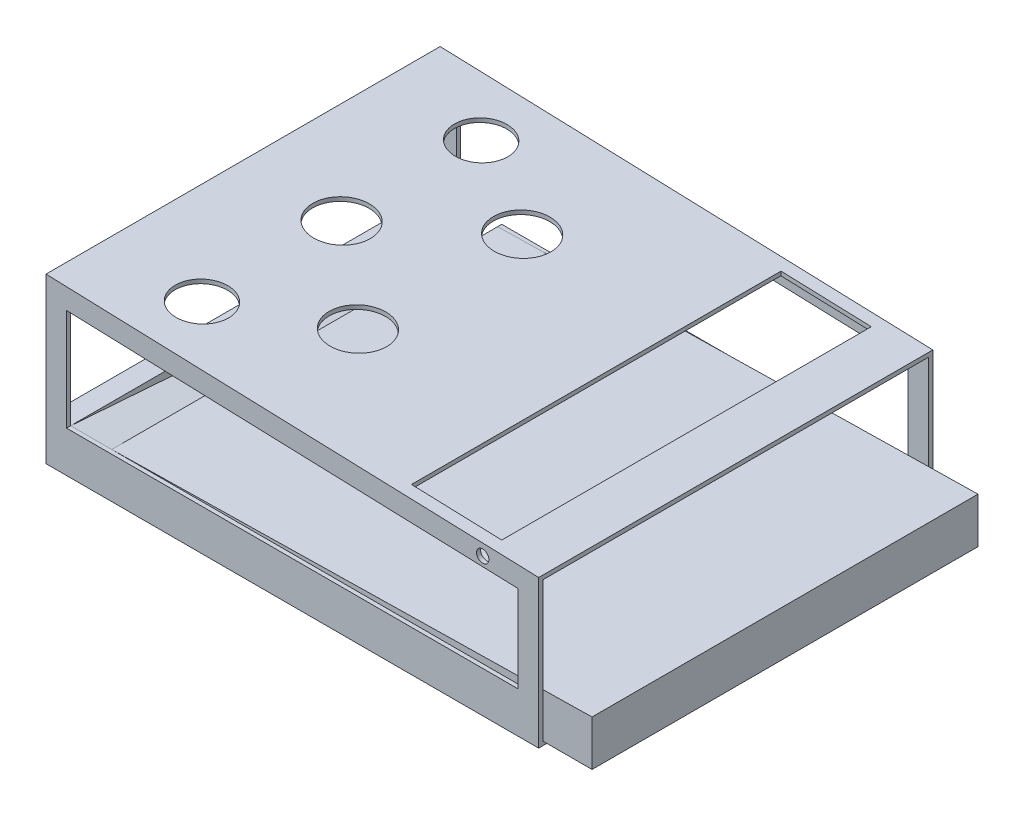
ISO-10303-21;
HEADER;
FILE_DESCRIPTION(('STEP AP214'),'2;1');
FILE_NAME('part.step','',(''),(''),'','','');
FILE_SCHEMA(('AUTOMOTIVE_DESIGN { 1 0 10303 214 1 1 1 1 }'));
ENDSEC;
DATA;
#1=APPLICATION_CONTEXT('core data for automotive mechanical design processes');
#2=APPLICATION_PROTOCOL_DEFINITION('international standard','automotive_design',2000,#1);
#3=PRODUCT_CONTEXT('',#1,'mechanical');
#4=PRODUCT('Part','Part','',(#3));
#5=PRODUCT_RELATED_PRODUCT_CATEGORY('part','',(#4));
#6=PRODUCT_DEFINITION_FORMATION('','',#4);
#7=PRODUCT_DEFINITION_CONTEXT('part definition',#1,'design');
#8=PRODUCT_DEFINITION('design','',#6,#7);
#9=PRODUCT_DEFINITION_SHAPE('','',#8);
#10=(LENGTH_UNIT() NAMED_UNIT(*) SI_UNIT(.MILLI.,.METRE.));
#11=(NAMED_UNIT(*) PLANE_ANGLE_UNIT() SI_UNIT($,.RADIAN.));
#12=(NAMED_UNIT(*) SI_UNIT($,.STERADIAN.) SOLID_ANGLE_UNIT());
#13=UNCERTAINTY_MEASURE_WITH_UNIT(LENGTH_MEASURE(1.E-05),#10,'distance_accuracy_value','');
#14=(GEOMETRIC_REPRESENTATION_CONTEXT(3) GLOBAL_UNCERTAINTY_ASSIGNED_CONTEXT((#13)) GLOBAL_UNIT_ASSIGNED_CONTEXT((#10,
#11,#12)) REPRESENTATION_CONTEXT('',''));
#15=CARTESIAN_POINT('',(0.,0.,0.));
#16=DIRECTION('',(0.,0.,1.));
#17=DIRECTION('',(1.,0.,0.));
#18=AXIS2_PLACEMENT_3D('',#15,#16,#17);
#19=CARTESIAN_POINT('',(0.,0.,-603.25));
#20=DIRECTION('',(0.,0.,-1.));
#21=DIRECTION('',(-1.,0.,0.));
#22=AXIS2_PLACEMENT_3D('',#19,#20,#21);
#23=PLANE('',#22);
#24=CARTESIAN_POINT('',(301.467767378111,213.990365251798,-603.25));
#25=DIRECTION('',(0.,0.,-1.));
#26=DIRECTION('',(-1.,0.,0.));
#27=AXIS2_PLACEMENT_3D('',#24,#25,#26);
#28=CIRCLE('',#27,9.52500000000002);
#29=CARTESIAN_POINT('',(291.942767378111,213.990365251798,-603.25));
#30=VERTEX_POINT('',#29);
#31=EDGE_CURVE('E591',#30,#30,#28,.T.);
#32=ORIENTED_EDGE('',*,*,#31,.T.);
#33=EDGE_LOOP('',(#32));
#34=FACE_BOUND('',#33,.T.);
#35=DIRECTION('',(0.,-1.,0.));
#36=VECTOR('',#35,1.);
#37=CARTESIAN_POINT('',(-373.981578947369,0.,-603.25));
#38=LINE('',#37,#36);
#39=CARTESIAN_POINT('',(-373.981578947369,247.646473201616,-603.25));
#40=VERTEX_POINT('',#39);
#41=CARTESIAN_POINT('',(-373.981578947369,63.4999999999999,-603.25));
#42=VERTEX_POINT('',#41);
#43=EDGE_CURVE('E454',#40,#42,#38,.T.);
#44=ORIENTED_EDGE('',*,*,#43,.T.);
#45=DIRECTION('',(1.,0.,0.));
#46=VECTOR('',#45,1.);
#47=CARTESIAN_POINT('',(0.,63.4999999999999,-603.25));
#48=LINE('',#47,#46);
#49=CARTESIAN_POINT('',(-342.231578947369,63.4999999999999,-603.25));
#50=VERTEX_POINT('',#49);
#51=EDGE_CURVE('E326',#42,#50,#48,.T.);
#52=ORIENTED_EDGE('',*,*,#51,.T.);
#53=DIRECTION('',(0.,1.,0.));
#54=VECTOR('',#53,1.);
#55=CARTESIAN_POINT('',(-342.231578947369,0.,-603.25));
#56=LINE('',#55,#54);
#57=CARTESIAN_POINT('',(-342.231578947369,221.174032674749,-603.25));
#58=VERTEX_POINT('',#57);
#59=EDGE_CURVE('E441',#50,#58,#56,.T.);
#60=ORIENTED_EDGE('',*,*,#59,.T.);
#61=DIRECTION('',(0.999444906979154,-0.0333148302326383,0.));
#62=VECTOR('',#61,1.);
#63=CARTESIAN_POINT('',(6.98444994594347,209.533498378305,-603.25));
#64=LINE('',#63,#62);
#65=CARTESIAN_POINT('',(356.268421052631,197.890699341416,-603.25));
#66=VERTEX_POINT('',#65);
#67=EDGE_CURVE('E445',#58,#66,#64,.T.);
#68=ORIENTED_EDGE('',*,*,#67,.T.);
#69=DIRECTION('',(0.,-1.,0.));
#70=VECTOR('',#69,1.);
#71=CARTESIAN_POINT('',(356.268421052632,1.47159515479055E-13,-603.25));
#72=LINE('',#71,#70);
#73=CARTESIAN_POINT('',(356.268421052631,74.7790793881739,-603.25));
#74=VERTEX_POINT('',#73);
#75=EDGE_CURVE('E433',#66,#74,#72,.T.);
#76=ORIENTED_EDGE('',*,*,#75,.T.);
#77=DIRECTION('',(-0.999842287138879,-0.0177595283973115,0.));
#78=VECTOR('',#77,1.);
#79=CARTESIAN_POINT('',(-278.731578947369,63.4999999999999,-603.25));
#80=LINE('',#79,#78);
#81=CARTESIAN_POINT('',(388.018421052632,75.3430333575826,-603.25));
#82=VERTEX_POINT('',#81);
#83=EDGE_CURVE('E366',#82,#74,#80,.T.);
#84=ORIENTED_EDGE('',*,*,#83,.F.);
#85=DIRECTION('',(0.,1.,0.));
#86=VECTOR('',#85,1.);
#87=CARTESIAN_POINT('',(388.018421052632,0.,-603.25));
#88=LINE('',#87,#86);
#89=CARTESIAN_POINT('',(388.018421052632,222.246473201617,-603.25));
#90=VERTEX_POINT('',#89);
#91=EDGE_CURVE('E465',#82,#90,#88,.T.);
#92=ORIENTED_EDGE('',*,*,#91,.T.);
#93=DIRECTION('',(-0.999444906979154,0.0333148302326384,0.));
#94=VECTOR('',#93,1.);
#95=CARTESIAN_POINT('',(-374.193128119346,247.653524840682,-603.25));
#96=LINE('',#95,#94);
#97=EDGE_CURVE('E450',#90,#40,#96,.T.);
#98=ORIENTED_EDGE('',*,*,#97,.T.);
#99=EDGE_LOOP('',(#44,#52,#60,#68,#76,#84,#92,#98));
#100=FACE_BOUND('',#99,.T.);
#101=ADVANCED_FACE('F44',(#34,#100),#23,.F.);
#102=CARTESIAN_POINT('',(0.,0.,-6.35));
#103=DIRECTION('',(0.,0.,-1.));
#104=DIRECTION('',(-1.,0.,0.));
#105=AXIS2_PLACEMENT_3D('',#102,#103,#104);
#106=PLANE('',#105);
#107=CARTESIAN_POINT('',(301.467767378111,213.990365251798,-6.34999999999997));
#108=DIRECTION('',(0.,0.,-1.));
#109=DIRECTION('',(-1.,0.,0.));
#110=AXIS2_PLACEMENT_3D('',#107,#108,#109);
#111=CIRCLE('',#110,9.52500000000002);
#112=CARTESIAN_POINT('',(291.942767378111,213.990365251798,-6.34999999999997));
#113=VERTEX_POINT('',#112);
#114=EDGE_CURVE('E596',#113,#113,#111,.T.);
#115=ORIENTED_EDGE('',*,*,#114,.F.);
#116=EDGE_LOOP('',(#115));
#117=FACE_BOUND('',#116,.T.);
#118=DIRECTION('',(0.,1.,0.));
#119=VECTOR('',#118,1.);
#120=CARTESIAN_POINT('',(-342.231578947369,0.,-6.35));
#121=LINE('',#120,#119);
#122=CARTESIAN_POINT('',(-342.231578947369,63.4999999999999,-6.35));
#123=VERTEX_POINT('',#122);
#124=CARTESIAN_POINT('',(-342.231578947369,221.174032674749,-6.35000000000008));
#125=VERTEX_POINT('',#124);
#126=EDGE_CURVE('E537',#123,#125,#121,.T.);
#127=ORIENTED_EDGE('',*,*,#126,.F.);
#128=DIRECTION('',(1.,0.,0.));
#129=VECTOR('',#128,1.);
#130=CARTESIAN_POINT('',(-973.611241739329,63.4999999999999,-6.35));
#131=LINE('',#130,#129);
#132=CARTESIAN_POINT('',(-373.981578947369,63.4999999999999,-6.34999999999997));
#133=VERTEX_POINT('',#132);
#134=EDGE_CURVE('E332',#133,#123,#131,.T.);
#135=ORIENTED_EDGE('',*,*,#134,.F.);
#136=DIRECTION('',(0.,-1.,0.));
#137=VECTOR('',#136,1.);
#138=CARTESIAN_POINT('',(-373.981578947369,0.,-6.34999999999997));
#139=LINE('',#138,#137);
#140=CARTESIAN_POINT('',(-373.981578947369,247.646473201616,-6.35));
#141=VERTEX_POINT('',#140);
#142=EDGE_CURVE('E460',#141,#133,#139,.T.);
#143=ORIENTED_EDGE('',*,*,#142,.F.);
#144=DIRECTION('',(-0.999444906979154,0.0333148302326384,0.));
#145=VECTOR('',#144,1.);
#146=CARTESIAN_POINT('',(-374.193128119346,247.653524840682,-6.34999999999997));
#147=LINE('',#146,#145);
#148=CARTESIAN_POINT('',(388.018421052632,222.246473201617,-6.35));
#149=VERTEX_POINT('',#148);
#150=EDGE_CURVE('E456',#149,#141,#147,.T.);
#151=ORIENTED_EDGE('',*,*,#150,.F.);
#152=DIRECTION('',(0.,1.,0.));
#153=VECTOR('',#152,1.);
#154=CARTESIAN_POINT('',(388.018421052632,0.,-6.34999999999997));
#155=LINE('',#154,#153);
#156=CARTESIAN_POINT('',(388.018421052632,75.3430333575826,-6.34999999999998));
#157=VERTEX_POINT('',#156);
#158=EDGE_CURVE('E449',#157,#149,#155,.T.);
#159=ORIENTED_EDGE('',*,*,#158,.F.);
#160=DIRECTION('',(0.999842287138879,0.0177595283973115,0.));
#161=VECTOR('',#160,1.);
#162=CARTESIAN_POINT('',(-278.731578947369,63.4999999999999,-6.34999999999997));
#163=LINE('',#162,#161);
#164=CARTESIAN_POINT('',(356.268421052631,74.7790793881739,-6.35));
#165=VERTEX_POINT('',#164);
#166=EDGE_CURVE('E381',#165,#157,#163,.T.);
#167=ORIENTED_EDGE('',*,*,#166,.F.);
#168=DIRECTION('',(0.,-1.,0.));
#169=VECTOR('',#168,1.);
#170=CARTESIAN_POINT('',(356.268421052632,1.47159515479055E-13,-6.35));
#171=LINE('',#170,#169);
#172=CARTESIAN_POINT('',(356.268421052631,197.890699341416,-6.35));
#173=VERTEX_POINT('',#172);
#174=EDGE_CURVE('E520',#173,#165,#171,.T.);
#175=ORIENTED_EDGE('',*,*,#174,.F.);
#176=DIRECTION('',(0.999444906979154,-0.0333148302326383,0.));
#177=VECTOR('',#176,1.);
#178=CARTESIAN_POINT('',(6.98444994594347,209.533498378305,-6.35));
#179=LINE('',#178,#177);
#180=EDGE_CURVE('E53',#125,#173,#179,.T.);
#181=ORIENTED_EDGE('',*,*,#180,.F.);
#182=EDGE_LOOP('',(#127,#135,#143,#151,#159,#167,#175,#181));
#183=FACE_BOUND('',#182,.T.);
#184=ADVANCED_FACE('F547',(#117,#183),#106,.T.);
#185=CARTESIAN_POINT('',(-278.731578947369,63.4999999999999,739.92296331965));
#186=DIRECTION('',(1.,0.,0.));
#187=DIRECTION('',(0.,0.,-1.));
#188=AXIS2_PLACEMENT_3D('',#185,#186,#187);
#189=PLANE('',#188);
#190=DIRECTION('',(0.,-0.0742624587146073,-0.997238731310443));
#191=VECTOR('',#190,1.);
#192=CARTESIAN_POINT('',(-278.731578947369,63.4999999999999,-6.35));
#193=LINE('',#192,#191);
#194=CARTESIAN_POINT('',(-278.731578947369,63.4999999999999,-6.35));
#195=VERTEX_POINT('',#194);
#196=CARTESIAN_POINT('',(-278.731578947369,19.05,-603.25));
#197=VERTEX_POINT('',#196);
#198=EDGE_CURVE('E333',#195,#197,#193,.T.);
#199=ORIENTED_EDGE('',*,*,#198,.F.);
#200=DIRECTION('',(0.,0.,-1.));
#201=VECTOR('',#200,1.);
#202=CARTESIAN_POINT('',(-278.731578947369,63.4999999999999,739.92296331965));
#203=LINE('',#202,#201);
#204=CARTESIAN_POINT('',(-278.731578947369,63.4999999999999,-603.25));
#205=VERTEX_POINT('',#204);
#206=EDGE_CURVE('E365',#195,#205,#203,.T.);
#207=ORIENTED_EDGE('',*,*,#206,.T.);
#208=DIRECTION('',(0.,0.,-1.));
#209=VECTOR('',#208,1.);
#210=CARTESIAN_POINT('',(-278.731578947369,63.4999999999999,-525.738371840091));
#211=LINE('',#210,#209);
#212=CARTESIAN_POINT('',(-278.731578947369,63.4999999999999,-609.6));
#213=VERTEX_POINT('',#212);
#214=EDGE_CURVE('E312',#205,#213,#211,.T.);
#215=ORIENTED_EDGE('',*,*,#214,.T.);
#216=DIRECTION('',(0.,-1.,0.));
#217=VECTOR('',#216,1.);
#218=CARTESIAN_POINT('',(-278.731578947369,63.4999999999999,-609.6));
#219=LINE('',#218,#217);
#220=CARTESIAN_POINT('',(-278.731578947369,19.05,-609.6));
#221=VERTEX_POINT('',#220);
#222=EDGE_CURVE('E303',#213,#221,#219,.T.);
#223=ORIENTED_EDGE('',*,*,#222,.T.);
#224=DIRECTION('',(0.,0.,-1.));
#225=VECTOR('',#224,1.);
#226=CARTESIAN_POINT('',(-278.731578947369,19.05,-525.738371840091));
#227=LINE('',#226,#225);
#228=EDGE_CURVE('E311',#197,#221,#227,.T.);
#229=ORIENTED_EDGE('',*,*,#228,.F.);
#230=EDGE_LOOP('',(#199,#207,#215,#223,#229));
#231=FACE_BOUND('',#230,.T.);
#232=ADVANCED_FACE('F655',(#231),#189,.F.);
#233=CARTESIAN_POINT('',(388.018421052632,0.,-609.6));
#234=DIRECTION('',(1.,0.,0.));
#235=DIRECTION('',(0.,0.,-1.));
#236=AXIS2_PLACEMENT_3D('',#233,#234,#235);
#237=PLANE('',#236);
#238=DIRECTION('',(0.,1.,0.));
#239=VECTOR('',#238,1.);
#240=CARTESIAN_POINT('',(388.018421052632,0.,0.));
#241=LINE('',#240,#239);
#242=CARTESIAN_POINT('',(388.018421052632,0.,0.));
#243=VERTEX_POINT('',#242);
#244=CARTESIAN_POINT('',(388.018421052632,228.6,0.));
#245=VERTEX_POINT('',#244);
#246=EDGE_CURVE('E476',#243,#245,#241,.T.);
#247=ORIENTED_EDGE('',*,*,#246,.F.);
#248=DIRECTION('',(0.,0.,1.));
#249=VECTOR('',#248,1.);
#250=CARTESIAN_POINT('',(388.018421052632,0.,-609.6));
#251=LINE('',#250,#249);
#252=CARTESIAN_POINT('',(388.018421052632,0.,-609.6));
#253=VERTEX_POINT('',#252);
#254=EDGE_CURVE('E517',#253,#243,#251,.T.);
#255=ORIENTED_EDGE('',*,*,#254,.F.);
#256=DIRECTION('',(0.,1.,0.));
#257=VECTOR('',#256,1.);
#258=CARTESIAN_POINT('',(388.018421052632,0.,-609.6));
#259=LINE('',#258,#257);
#260=CARTESIAN_POINT('',(388.018421052632,228.6,-609.6));
#261=VERTEX_POINT('',#260);
#262=EDGE_CURVE('E486',#253,#261,#259,.T.);
#263=ORIENTED_EDGE('',*,*,#262,.T.);
#264=DIRECTION('',(0.,0.,1.));
#265=VECTOR('',#264,1.);
#266=CARTESIAN_POINT('',(388.018421052632,228.6,-609.6));
#267=LINE('',#266,#265);
#268=EDGE_CURVE('E502',#261,#245,#267,.T.);
#269=ORIENTED_EDGE('',*,*,#268,.T.);
#270=EDGE_LOOP('',(#247,#255,#263,#269));
#271=FACE_BOUND('',#270,.T.);
#272=DIRECTION('',(0.,0.,1.));
#273=VECTOR('',#272,1.);
#274=CARTESIAN_POINT('',(388.018421052632,6.35,-609.6));
#275=LINE('',#274,#273);
#276=CARTESIAN_POINT('',(388.018421052632,6.35,-603.25));
#277=VERTEX_POINT('',#276);
#278=CARTESIAN_POINT('',(388.018421052632,6.35,-6.35));
#279=VERTEX_POINT('',#278);
#280=EDGE_CURVE('E470',#277,#279,#275,.T.);
#281=ORIENTED_EDGE('',*,*,#280,.T.);
#282=EDGE_CURVE('E461',#279,#157,#155,.T.);
#283=ORIENTED_EDGE('',*,*,#282,.T.);
#284=ORIENTED_EDGE('',*,*,#158,.T.);
#285=DIRECTION('',(0.,0.,1.));
#286=VECTOR('',#285,1.);
#287=CARTESIAN_POINT('',(388.018421052632,222.246473201617,-609.6));
#288=LINE('',#287,#286);
#289=EDGE_CURVE('E471',#90,#149,#288,.T.);
#290=ORIENTED_EDGE('',*,*,#289,.F.);
#291=ORIENTED_EDGE('',*,*,#91,.F.);
#292=EDGE_CURVE('E455',#277,#82,#88,.T.);
#293=ORIENTED_EDGE('',*,*,#292,.F.);
#294=EDGE_LOOP('',(#281,#283,#284,#290,#291,#293));
#295=FACE_BOUND('',#294,.T.);
#296=ADVANCED_FACE('F46',(#271,#295),#237,.T.);
#297=CARTESIAN_POINT('',(-373.981578947369,0.,-609.6));
#298=DIRECTION('',(-1.,0.,0.));
#299=DIRECTION('',(0.,0.,1.));
#300=AXIS2_PLACEMENT_3D('',#297,#298,#299);
#301=PLANE('',#300);
#302=DIRECTION('',(0.,0.,-1.));
#303=VECTOR('',#302,1.);
#304=CARTESIAN_POINT('',(-373.981578947369,63.4999999999999,48.2747654457206));
#305=LINE('',#304,#303);
#306=EDGE_CURVE('E315',#133,#42,#305,.T.);
#307=ORIENTED_EDGE('',*,*,#306,.T.);
#308=ORIENTED_EDGE('',*,*,#43,.F.);
#309=DIRECTION('',(0.,0.,1.));
#310=VECTOR('',#309,1.);
#311=CARTESIAN_POINT('',(-373.981578947369,247.646473201616,-609.6));
#312=LINE('',#311,#310);
#313=EDGE_CURVE('E466',#40,#141,#312,.T.);
#314=ORIENTED_EDGE('',*,*,#313,.T.);
#315=ORIENTED_EDGE('',*,*,#142,.T.);
#316=EDGE_LOOP('',(#307,#308,#314,#315));
#317=FACE_BOUND('',#316,.T.);
#318=DIRECTION('',(0.,-1.,0.));
#319=VECTOR('',#318,1.);
#320=CARTESIAN_POINT('',(-373.981578947369,0.,-609.6));
#321=LINE('',#320,#319);
#322=CARTESIAN_POINT('',(-373.981578947369,254.,-609.6));
#323=VERTEX_POINT('',#322);
#324=CARTESIAN_POINT('',(-373.981578947369,0.,-609.6));
#325=VERTEX_POINT('',#324);
#326=EDGE_CURVE('E495',#323,#325,#321,.T.);
#327=ORIENTED_EDGE('',*,*,#326,.T.);
#328=DIRECTION('',(0.,0.,1.));
#329=VECTOR('',#328,1.);
#330=CARTESIAN_POINT('',(-373.981578947369,0.,-609.6));
#331=LINE('',#330,#329);
#332=CARTESIAN_POINT('',(-373.981578947369,0.,0.));
#333=VERTEX_POINT('',#332);
#334=EDGE_CURVE('E521',#325,#333,#331,.T.);
#335=ORIENTED_EDGE('',*,*,#334,.T.);
#336=DIRECTION('',(0.,-1.,0.));
#337=VECTOR('',#336,1.);
#338=CARTESIAN_POINT('',(-373.981578947369,0.,0.));
#339=LINE('',#338,#337);
#340=CARTESIAN_POINT('',(-373.981578947369,254.,0.));
#341=VERTEX_POINT('',#340);
#342=EDGE_CURVE('E510',#341,#333,#339,.T.);
#343=ORIENTED_EDGE('',*,*,#342,.F.);
#344=DIRECTION('',(0.,0.,1.));
#345=VECTOR('',#344,1.);
#346=CARTESIAN_POINT('',(-373.981578947369,254.,-609.6));
#347=LINE('',#346,#345);
#348=EDGE_CURVE('E524',#323,#341,#347,.T.);
#349=ORIENTED_EDGE('',*,*,#348,.F.);
#350=EDGE_LOOP('',(#327,#335,#343,#349));
#351=FACE_BOUND('',#350,.T.);
#352=ADVANCED_FACE('F636',(#317,#351),#301,.T.);
#353=CARTESIAN_POINT('',(-373.981578947369,0.,-609.6));
#354=DIRECTION('',(0.,-1.,0.));
#355=DIRECTION('',(0.,0.,-1.));
#356=AXIS2_PLACEMENT_3D('',#353,#354,#355);
#357=PLANE('',#356);
#358=DIRECTION('',(1.,0.,0.));
#359=VECTOR('',#358,1.);
#360=CARTESIAN_POINT('',(-373.981578947369,0.,0.));
#361=LINE('',#360,#359);
#362=EDGE_CURVE('E491',#333,#243,#361,.T.);
#363=ORIENTED_EDGE('',*,*,#362,.F.);
#364=ORIENTED_EDGE('',*,*,#334,.F.);
#365=DIRECTION('',(1.,0.,0.));
#366=VECTOR('',#365,1.);
#367=CARTESIAN_POINT('',(-373.981578947369,0.,-609.6));
#368=LINE('',#367,#366);
#369=EDGE_CURVE('E498',#325,#253,#368,.T.);
#370=ORIENTED_EDGE('',*,*,#369,.T.);
#371=ORIENTED_EDGE('',*,*,#254,.T.);
#372=EDGE_LOOP('',(#363,#364,#370,#371));
#373=FACE_BOUND('',#372,.T.);
#374=ADVANCED_FACE('F639',(#373),#357,.T.);
#375=CARTESIAN_POINT('',(-373.981578947369,254.,-609.6));
#376=DIRECTION('',(0.0333148302326384,0.999444906979154,0.));
#377=DIRECTION('',(-0.999444906979154,0.0333148302326384,0.));
#378=AXIS2_PLACEMENT_3D('',#375,#376,#377);
#379=PLANE('',#378);
#380=DIRECTION('',(0.,0.,-1.));
#381=VECTOR('',#380,1.);
#382=CARTESIAN_POINT('',(311.86071914082,231.138590063727,-19.05));
#383=LINE('',#382,#381);
#384=CARTESIAN_POINT('',(311.86071914082,231.138590063727,-19.05));
#385=VERTEX_POINT('',#384);
#386=CARTESIAN_POINT('',(311.86071914082,231.138590063727,-590.55));
#387=VERTEX_POINT('',#386);
#388=EDGE_CURVE('E60',#385,#387,#383,.T.);
#389=ORIENTED_EDGE('',*,*,#388,.F.);
#390=DIRECTION('',(0.999444906979154,-0.0333148302326383,0.));
#391=VECTOR('',#390,1.);
#392=CARTESIAN_POINT('',(311.86071914082,231.138590063727,-19.05));
#393=LINE('',#392,#391);
#394=CARTESIAN_POINT('',(172.238265635832,235.792671847227,-19.05));
#395=VERTEX_POINT('',#394);
#396=EDGE_CURVE('E245',#395,#385,#393,.T.);
#397=ORIENTED_EDGE('',*,*,#396,.F.);
#398=DIRECTION('',(0.,0.,1.));
#399=VECTOR('',#398,1.);
#400=CARTESIAN_POINT('',(172.238265635832,235.792671847227,-19.05));
#401=LINE('',#400,#399);
#402=CARTESIAN_POINT('',(172.238265635832,235.792671847227,-590.55));
#403=VERTEX_POINT('',#402);
#404=EDGE_CURVE('E227',#403,#395,#401,.T.);
#405=ORIENTED_EDGE('',*,*,#404,.F.);
#406=DIRECTION('',(-0.999444906979154,0.0333148302326383,0.));
#407=VECTOR('',#406,1.);
#408=CARTESIAN_POINT('',(311.86071914082,231.138590063727,-590.55));
#409=LINE('',#408,#407);
#410=EDGE_CURVE('E237',#387,#403,#409,.T.);
#411=ORIENTED_EDGE('',*,*,#410,.F.);
#412=EDGE_LOOP('',(#389,#397,#405,#411));
#413=FACE_BOUND('',#412,.T.);
#414=CARTESIAN_POINT('',(-69.3507713001223,243.845639745092,-177.8));
#415=DIRECTION('',(0.0333148302326384,0.999444906979154,0.));
#416=DIRECTION('',(0.999444906979154,-0.0333148302326384,0.));
#417=AXIS2_PLACEMENT_3D('',#414,#415,#416);
#418=CIRCLE('',#417,44.45);
#419=CARTESIAN_POINT('',(-24.9254451848989,242.364795541251,-177.8));
#420=VERTEX_POINT('',#419);
#421=EDGE_CURVE('E286',#420,#420,#418,.T.);
#422=ORIENTED_EDGE('',*,*,#421,.F.);
#423=EDGE_LOOP('',(#422));
#424=FACE_BOUND('',#423,.T.);
#425=CARTESIAN_POINT('',(-69.3507713001223,243.845639745092,-431.8));
#426=DIRECTION('',(0.0333148302326384,0.999444906979154,0.));
#427=DIRECTION('',(-0.999444906979154,0.0333148302326384,0.));
#428=AXIS2_PLACEMENT_3D('',#425,#426,#427);
#429=CIRCLE('',#428,44.45);
#430=CARTESIAN_POINT('',(-113.776097415346,245.326483948933,-431.8));
#431=VERTEX_POINT('',#430);
#432=EDGE_CURVE('E278',#431,#431,#429,.T.);
#433=ORIENTED_EDGE('',*,*,#432,.F.);
#434=EDGE_LOOP('',(#433));
#435=FACE_BOUND('',#434,.T.);
#436=CARTESIAN_POINT('',(-221.666175123745,248.922819872546,-520.7));
#437=DIRECTION('',(0.0333148302326384,0.999444906979154,0.));
#438=DIRECTION('',(0.999444906979154,-0.0333148302326384,0.));
#439=AXIS2_PLACEMENT_3D('',#436,#437,#438);
#440=CIRCLE('',#439,41.275);
#441=CARTESIAN_POINT('',(-180.414086588181,247.547750254694,-520.7));
#442=VERTEX_POINT('',#441);
#443=EDGE_CURVE('E269',#442,#442,#440,.T.);
#444=ORIENTED_EDGE('',*,*,#443,.F.);
#445=EDGE_LOOP('',(#444));
#446=FACE_BOUND('',#445,.T.);
#447=CARTESIAN_POINT('',(-221.666175123745,248.922819872546,-88.9));
#448=DIRECTION('',(0.0333148302326384,0.999444906979154,0.));
#449=DIRECTION('',(-0.999444906979154,0.0333148302326384,0.));
#450=AXIS2_PLACEMENT_3D('',#447,#448,#449);
#451=CIRCLE('',#450,41.275);
#452=CARTESIAN_POINT('',(-262.91826365931,250.297889490398,-88.9));
#453=VERTEX_POINT('',#452);
#454=EDGE_CURVE('E268',#453,#453,#451,.T.);
#455=ORIENTED_EDGE('',*,*,#454,.F.);
#456=EDGE_LOOP('',(#455));
#457=FACE_BOUND('',#456,.T.);
#458=CARTESIAN_POINT('',(-221.666175123745,248.922819872546,-304.8));
#459=DIRECTION('',(0.0333148302326384,0.999444906979154,0.));
#460=DIRECTION('',(-0.999444906979154,0.0333148302326384,0.));
#461=AXIS2_PLACEMENT_3D('',#458,#459,#460);
#462=CIRCLE('',#461,44.45);
#463=CARTESIAN_POINT('',(-266.091501238969,250.403664076387,-304.8));
#464=VERTEX_POINT('',#463);
#465=EDGE_CURVE('E273',#464,#464,#462,.T.);
#466=ORIENTED_EDGE('',*,*,#465,.F.);
#467=EDGE_LOOP('',(#466));
#468=FACE_BOUND('',#467,.T.);
#469=DIRECTION('',(-0.999444906979154,0.0333148302326384,0.));
#470=VECTOR('',#469,1.);
#471=CARTESIAN_POINT('',(-373.981578947369,254.,0.));
#472=LINE('',#471,#470);
#473=EDGE_CURVE('E506',#245,#341,#472,.T.);
#474=ORIENTED_EDGE('',*,*,#473,.F.);
#475=ORIENTED_EDGE('',*,*,#268,.F.);
#476=DIRECTION('',(-0.999444906979154,0.0333148302326384,0.));
#477=VECTOR('',#476,1.);
#478=CARTESIAN_POINT('',(-373.981578947369,254.,-609.6));
#479=LINE('',#478,#477);
#480=EDGE_CURVE('E490',#261,#323,#479,.T.);
#481=ORIENTED_EDGE('',*,*,#480,.T.);
#482=ORIENTED_EDGE('',*,*,#348,.T.);
#483=EDGE_LOOP('',(#474,#475,#481,#482));
#484=FACE_BOUND('',#483,.T.);
#485=ADVANCED_FACE('F242',(#413,#424,#435,#446,#457,#468,#484),#379,.T.);
#486=CARTESIAN_POINT('',(0.,0.,-609.6));
#487=DIRECTION('',(0.,0.,-1.));
#488=DIRECTION('',(-1.,0.,0.));
#489=AXIS2_PLACEMENT_3D('',#486,#487,#488);
#490=PLANE('',#489);
#491=CARTESIAN_POINT('',(301.467767378111,213.990365251798,-609.6));
#492=DIRECTION('',(0.,0.,-1.));
#493=DIRECTION('',(-1.,0.,0.));
#494=AXIS2_PLACEMENT_3D('',#491,#492,#493);
#495=CIRCLE('',#494,9.52500000000002);
#496=CARTESIAN_POINT('',(291.942767378111,213.990365251798,-609.6));
#497=VERTEX_POINT('',#496);
#498=EDGE_CURVE('E601',#497,#497,#495,.F.);
#499=ORIENTED_EDGE('',*,*,#498,.T.);
#500=EDGE_LOOP('',(#499));
#501=FACE_BOUND('',#500,.T.);
#502=ORIENTED_EDGE('',*,*,#222,.F.);
#503=DIRECTION('',(1.,0.,0.));
#504=VECTOR('',#503,1.);
#505=CARTESIAN_POINT('',(356.268421052632,63.5,-609.6));
#506=LINE('',#505,#504);
#507=CARTESIAN_POINT('',(356.268421052632,63.5,-609.6));
#508=VERTEX_POINT('',#507);
#509=EDGE_CURVE('E411',#213,#508,#506,.T.);
#510=ORIENTED_EDGE('',*,*,#509,.T.);
#511=DIRECTION('',(0.,1.,0.));
#512=VECTOR('',#511,1.);
#513=CARTESIAN_POINT('',(356.268421052631,197.890699341416,-609.6));
#514=LINE('',#513,#512);
#515=CARTESIAN_POINT('',(356.268421052631,197.890699341416,-609.6));
#516=VERTEX_POINT('',#515);
#517=EDGE_CURVE('E405',#508,#516,#514,.T.);
#518=ORIENTED_EDGE('',*,*,#517,.T.);
#519=DIRECTION('',(-0.999444906979154,0.0333148302326383,0.));
#520=VECTOR('',#519,1.);
#521=CARTESIAN_POINT('',(-342.231578947369,221.174032674749,-609.6));
#522=LINE('',#521,#520);
#523=CARTESIAN_POINT('',(-342.231578947369,221.174032674749,-609.6));
#524=VERTEX_POINT('',#523);
#525=EDGE_CURVE('E389',#516,#524,#522,.T.);
#526=ORIENTED_EDGE('',*,*,#525,.T.);
#527=DIRECTION('',(0.,-1.,0.));
#528=VECTOR('',#527,1.);
#529=CARTESIAN_POINT('',(-342.231578947369,63.4999999999999,-609.6));
#530=LINE('',#529,#528);
#531=CARTESIAN_POINT('',(-342.231578947369,19.05,-609.6));
#532=VERTEX_POINT('',#531);
#533=EDGE_CURVE('E416',#524,#532,#530,.T.);
#534=ORIENTED_EDGE('',*,*,#533,.T.);
#535=DIRECTION('',(-1.,0.,0.));
#536=VECTOR('',#535,1.);
#537=CARTESIAN_POINT('',(-278.731578947369,19.05,-609.6));
#538=LINE('',#537,#536);
#539=EDGE_CURVE('E307',#221,#532,#538,.T.);
#540=ORIENTED_EDGE('',*,*,#539,.F.);
#541=EDGE_LOOP('',(#502,#510,#518,#526,#534,#540));
#542=FACE_BOUND('',#541,.T.);
#543=ORIENTED_EDGE('',*,*,#369,.F.);
#544=ORIENTED_EDGE('',*,*,#326,.F.);
#545=ORIENTED_EDGE('',*,*,#480,.F.);
#546=ORIENTED_EDGE('',*,*,#262,.F.);
#547=EDGE_LOOP('',(#543,#544,#545,#546));
#548=FACE_BOUND('',#547,.T.);
#549=ADVANCED_FACE('F619',(#501,#542,#548),#490,.T.);
#550=CARTESIAN_POINT('',(0.,0.,0.));
#551=DIRECTION('',(0.,0.,-1.));
#552=DIRECTION('',(-1.,0.,0.));
#553=AXIS2_PLACEMENT_3D('',#550,#551,#552);
#554=PLANE('',#553);
#555=CARTESIAN_POINT('',(301.467767378111,213.990365251798,0.));
#556=DIRECTION('',(0.,0.,1.));
#557=DIRECTION('',(1.,0.,0.));
#558=AXIS2_PLACEMENT_3D('',#555,#556,#557);
#559=CIRCLE('',#558,9.52500000000002);
#560=CARTESIAN_POINT('',(310.992767378111,213.990365251798,0.));
#561=VERTEX_POINT('',#560);
#562=EDGE_CURVE('E606',#561,#561,#559,.T.);
#563=ORIENTED_EDGE('',*,*,#562,.F.);
#564=EDGE_LOOP('',(#563));
#565=FACE_BOUND('',#564,.T.);
#566=DIRECTION('',(0.,-1.,0.));
#567=VECTOR('',#566,1.);
#568=CARTESIAN_POINT('',(-342.231578947369,63.4999999999999,0.));
#569=LINE('',#568,#567);
#570=CARTESIAN_POINT('',(-342.231578947369,221.174032674749,0.));
#571=VERTEX_POINT('',#570);
#572=CARTESIAN_POINT('',(-342.231578947369,63.4999999999999,0.));
#573=VERTEX_POINT('',#572);
#574=EDGE_CURVE('E390',#571,#573,#569,.T.);
#575=ORIENTED_EDGE('',*,*,#574,.F.);
#576=DIRECTION('',(-0.999444906979154,0.0333148302326383,0.));
#577=VECTOR('',#576,1.);
#578=CARTESIAN_POINT('',(-342.231578947369,221.174032674749,0.));
#579=LINE('',#578,#577);
#580=CARTESIAN_POINT('',(356.268421052631,197.890699341416,0.));
#581=VERTEX_POINT('',#580);
#582=EDGE_CURVE('E394',#581,#571,#579,.T.);
#583=ORIENTED_EDGE('',*,*,#582,.F.);
#584=DIRECTION('',(0.,1.,0.));
#585=VECTOR('',#584,1.);
#586=CARTESIAN_POINT('',(356.268421052631,197.890699341416,0.));
#587=LINE('',#586,#585);
#588=CARTESIAN_POINT('',(356.268421052632,63.5,0.));
#589=VERTEX_POINT('',#588);
#590=EDGE_CURVE('E385',#589,#581,#587,.T.);
#591=ORIENTED_EDGE('',*,*,#590,.F.);
#592=DIRECTION('',(1.,0.,0.));
#593=VECTOR('',#592,1.);
#594=CARTESIAN_POINT('',(356.268421052632,63.5,0.));
#595=LINE('',#594,#593);
#596=EDGE_CURVE('E386',#573,#589,#595,.T.);
#597=ORIENTED_EDGE('',*,*,#596,.F.);
#598=EDGE_LOOP('',(#575,#583,#591,#597));
#599=FACE_BOUND('',#598,.T.);
#600=ORIENTED_EDGE('',*,*,#246,.T.);
#601=ORIENTED_EDGE('',*,*,#473,.T.);
#602=ORIENTED_EDGE('',*,*,#342,.T.);
#603=ORIENTED_EDGE('',*,*,#362,.T.);
#604=EDGE_LOOP('',(#600,#601,#602,#603));
#605=FACE_BOUND('',#604,.T.);
#606=ADVANCED_FACE('F615',(#565,#599,#605),#554,.F.);
#607=CARTESIAN_POINT('',(-374.193128119346,247.653524840682,-609.6));
#608=DIRECTION('',(0.0333148302326384,0.999444906979154,0.));
#609=DIRECTION('',(-0.999444906979154,0.0333148302326384,0.));
#610=AXIS2_PLACEMENT_3D('',#607,#608,#609);
#611=PLANE('',#610);
#612=DIRECTION('',(-0.999444906979154,0.0333148302326384,0.));
#613=VECTOR('',#612,1.);
#614=CARTESIAN_POINT('',(311.649169968843,224.792114904409,-19.05));
#615=LINE('',#614,#613);
#616=CARTESIAN_POINT('',(311.649169968843,224.792114904409,-19.05));
#617=VERTEX_POINT('',#616);
#618=CARTESIAN_POINT('',(172.026716463855,229.446196687909,-19.05));
#619=VERTEX_POINT('',#618);
#620=EDGE_CURVE('E585',#617,#619,#615,.T.);
#621=ORIENTED_EDGE('',*,*,#620,.F.);
#622=DIRECTION('',(0.,0.,1.));
#623=VECTOR('',#622,1.);
#624=CARTESIAN_POINT('',(311.649169968843,224.792114904409,-19.05));
#625=LINE('',#624,#623);
#626=CARTESIAN_POINT('',(311.649169968843,224.792114904409,-590.55));
#627=VERTEX_POINT('',#626);
#628=EDGE_CURVE('E263',#627,#617,#625,.T.);
#629=ORIENTED_EDGE('',*,*,#628,.F.);
#630=DIRECTION('',(0.999444906979154,-0.0333148302326384,0.));
#631=VECTOR('',#630,1.);
#632=CARTESIAN_POINT('',(311.649169968843,224.792114904409,-590.55));
#633=LINE('',#632,#631);
#634=CARTESIAN_POINT('',(172.026716463855,229.446196687909,-590.55));
#635=VERTEX_POINT('',#634);
#636=EDGE_CURVE('E259',#635,#627,#633,.T.);
#637=ORIENTED_EDGE('',*,*,#636,.F.);
#638=DIRECTION('',(0.,0.,-1.));
#639=VECTOR('',#638,1.);
#640=CARTESIAN_POINT('',(172.026716463855,229.446196687909,-19.05));
#641=LINE('',#640,#639);
#642=EDGE_CURVE('E230',#619,#635,#641,.T.);
#643=ORIENTED_EDGE('',*,*,#642,.F.);
#644=EDGE_LOOP('',(#621,#629,#637,#643));
#645=FACE_BOUND('',#644,.T.);
#646=CARTESIAN_POINT('',(-69.5623204720996,237.499164585774,-177.8));
#647=DIRECTION('',(0.0333148302326384,0.999444906979154,0.));
#648=DIRECTION('',(-0.999444906979154,0.0333148302326384,0.));
#649=AXIS2_PLACEMENT_3D('',#646,#647,#648);
#650=CIRCLE('',#649,44.45);
#651=CARTESIAN_POINT('',(-113.987646587323,238.980008789615,-177.8));
#652=VERTEX_POINT('',#651);
#653=EDGE_CURVE('E262',#652,#652,#650,.F.);
#654=ORIENTED_EDGE('',*,*,#653,.F.);
#655=EDGE_LOOP('',(#654));
#656=FACE_BOUND('',#655,.T.);
#657=CARTESIAN_POINT('',(-69.5623204720996,237.499164585774,-431.8));
#658=DIRECTION('',(0.0333148302326384,0.999444906979154,0.));
#659=DIRECTION('',(-0.999444906979154,0.0333148302326384,0.));
#660=AXIS2_PLACEMENT_3D('',#657,#658,#659);
#661=CIRCLE('',#660,44.45);
#662=CARTESIAN_POINT('',(-113.987646587323,238.980008789615,-431.8));
#663=VERTEX_POINT('',#662);
#664=EDGE_CURVE('E282',#663,#663,#661,.F.);
#665=ORIENTED_EDGE('',*,*,#664,.F.);
#666=EDGE_LOOP('',(#665));
#667=FACE_BOUND('',#666,.T.);
#668=CARTESIAN_POINT('',(-221.877724295723,242.576344713228,-520.7));
#669=DIRECTION('',(0.0333148302326384,0.999444906979154,0.));
#670=DIRECTION('',(-0.999444906979154,0.0333148302326384,0.));
#671=AXIS2_PLACEMENT_3D('',#668,#669,#670);
#672=CIRCLE('',#671,41.275);
#673=CARTESIAN_POINT('',(-263.129812831287,243.95141433108,-520.7));
#674=VERTEX_POINT('',#673);
#675=EDGE_CURVE('E274',#674,#674,#672,.F.);
#676=ORIENTED_EDGE('',*,*,#675,.F.);
#677=EDGE_LOOP('',(#676));
#678=FACE_BOUND('',#677,.T.);
#679=CARTESIAN_POINT('',(-221.877724295723,242.576344713228,-88.9));
#680=DIRECTION('',(0.0333148302326384,0.999444906979154,0.));
#681=DIRECTION('',(-0.999444906979154,0.0333148302326384,0.));
#682=AXIS2_PLACEMENT_3D('',#679,#680,#681);
#683=CIRCLE('',#682,41.275);
#684=CARTESIAN_POINT('',(-263.129812831287,243.95141433108,-88.9));
#685=VERTEX_POINT('',#684);
#686=EDGE_CURVE('E264',#685,#685,#683,.F.);
#687=ORIENTED_EDGE('',*,*,#686,.F.);
#688=EDGE_LOOP('',(#687));
#689=FACE_BOUND('',#688,.T.);
#690=CARTESIAN_POINT('',(-221.877724295723,242.576344713228,-304.8));
#691=DIRECTION('',(0.0333148302326384,0.999444906979154,0.));
#692=DIRECTION('',(-0.999444906979154,0.0333148302326384,0.));
#693=AXIS2_PLACEMENT_3D('',#690,#691,#692);
#694=CIRCLE('',#693,44.45);
#695=CARTESIAN_POINT('',(-266.303050410946,244.057188917069,-304.8));
#696=VERTEX_POINT('',#695);
#697=EDGE_CURVE('E299',#696,#696,#694,.F.);
#698=ORIENTED_EDGE('',*,*,#697,.F.);
#699=EDGE_LOOP('',(#698));
#700=FACE_BOUND('',#699,.T.);
#701=ORIENTED_EDGE('',*,*,#150,.T.);
#702=ORIENTED_EDGE('',*,*,#313,.F.);
#703=ORIENTED_EDGE('',*,*,#97,.F.);
#704=ORIENTED_EDGE('',*,*,#289,.T.);
#705=EDGE_LOOP('',(#701,#702,#703,#704));
#706=FACE_BOUND('',#705,.T.);
#707=ADVANCED_FACE('F618',(#645,#656,#667,#678,#689,#700,#706),#611,.F.);
#708=CARTESIAN_POINT('',(356.268421052631,197.890699341416,-1325.67496156472));
#709=DIRECTION('',(1.,0.,0.));
#710=DIRECTION('',(0.,1.,0.));
#711=AXIS2_PLACEMENT_3D('',#708,#709,#710);
#712=PLANE('',#711);
#713=ORIENTED_EDGE('',*,*,#174,.T.);
#714=DIRECTION('',(0.,1.,0.));
#715=VECTOR('',#714,1.);
#716=CARTESIAN_POINT('',(356.268421052631,197.890699341416,-6.35000000000008));
#717=LINE('',#716,#715);
#718=CARTESIAN_POINT('',(356.268421052632,63.5,-6.35000000000008));
#719=VERTEX_POINT('',#718);
#720=EDGE_CURVE('E353',#719,#165,#717,.T.);
#721=ORIENTED_EDGE('',*,*,#720,.F.);
#722=DIRECTION('',(0.,0.,1.));
#723=VECTOR('',#722,1.);
#724=CARTESIAN_POINT('',(356.268421052632,63.5,-1325.67496156472));
#725=LINE('',#724,#723);
#726=EDGE_CURVE('E414',#719,#589,#725,.T.);
#727=ORIENTED_EDGE('',*,*,#726,.T.);
#728=ORIENTED_EDGE('',*,*,#590,.T.);
#729=DIRECTION('',(0.,0.,1.));
#730=VECTOR('',#729,1.);
#731=CARTESIAN_POINT('',(356.268421052631,197.890699341416,-1325.67496156472));
#732=LINE('',#731,#730);
#733=EDGE_CURVE('E409',#173,#581,#732,.T.);
#734=ORIENTED_EDGE('',*,*,#733,.F.);
#735=EDGE_LOOP('',(#713,#721,#727,#728,#734));
#736=FACE_BOUND('',#735,.T.);
#737=ADVANCED_FACE('F550',(#736),#712,.F.);
#738=CARTESIAN_POINT('',(356.268421052632,63.5,-1325.67496156472));
#739=DIRECTION('',(0.,-1.,0.));
#740=DIRECTION('',(1.,0.,0.));
#741=AXIS2_PLACEMENT_3D('',#738,#739,#740);
#742=PLANE('',#741);
#743=DIRECTION('',(-1.,0.,0.));
#744=VECTOR('',#743,1.);
#745=CARTESIAN_POINT('',(0.,63.5,-6.35));
#746=LINE('',#745,#744);
#747=EDGE_CURVE('E533',#719,#195,#746,.T.);
#748=ORIENTED_EDGE('',*,*,#747,.T.);
#749=EDGE_CURVE('E532',#195,#123,#746,.T.);
#750=ORIENTED_EDGE('',*,*,#749,.T.);
#751=DIRECTION('',(0.,0.,1.));
#752=VECTOR('',#751,1.);
#753=CARTESIAN_POINT('',(-342.231578947369,63.4999999999999,-1325.67496156472));
#754=LINE('',#753,#752);
#755=EDGE_CURVE('E415',#123,#573,#754,.T.);
#756=ORIENTED_EDGE('',*,*,#755,.T.);
#757=ORIENTED_EDGE('',*,*,#596,.T.);
#758=ORIENTED_EDGE('',*,*,#726,.F.);
#759=EDGE_LOOP('',(#748,#750,#756,#757,#758));
#760=FACE_BOUND('',#759,.T.);
#761=ADVANCED_FACE('F668',(#760),#742,.F.);
#762=CARTESIAN_POINT('',(-342.231578947369,63.4999999999999,-1325.67496156472));
#763=DIRECTION('',(-1.,0.,0.));
#764=DIRECTION('',(0.,0.,1.));
#765=AXIS2_PLACEMENT_3D('',#762,#763,#764);
#766=PLANE('',#765);
#767=ORIENTED_EDGE('',*,*,#126,.T.);
#768=DIRECTION('',(0.,0.,1.));
#769=VECTOR('',#768,1.);
#770=CARTESIAN_POINT('',(-342.231578947369,221.174032674749,-1325.67496156472));
#771=LINE('',#770,#769);
#772=EDGE_CURVE('E404',#125,#571,#771,.T.);
#773=ORIENTED_EDGE('',*,*,#772,.T.);
#774=ORIENTED_EDGE('',*,*,#574,.T.);
#775=ORIENTED_EDGE('',*,*,#755,.F.);
#776=EDGE_LOOP('',(#767,#773,#774,#775));
#777=FACE_BOUND('',#776,.T.);
#778=ADVANCED_FACE('F665',(#777),#766,.F.);
#779=CARTESIAN_POINT('',(-342.231578947369,221.174032674749,-1325.67496156472));
#780=DIRECTION('',(0.0333148302326383,0.999444906979154,0.));
#781=DIRECTION('',(-0.999444906979154,0.0333148302326383,0.));
#782=AXIS2_PLACEMENT_3D('',#779,#780,#781);
#783=PLANE('',#782);
#784=ORIENTED_EDGE('',*,*,#180,.T.);
#785=ORIENTED_EDGE('',*,*,#733,.T.);
#786=ORIENTED_EDGE('',*,*,#582,.T.);
#787=ORIENTED_EDGE('',*,*,#772,.F.);
#788=EDGE_LOOP('',(#784,#785,#786,#787));
#789=FACE_BOUND('',#788,.T.);
#790=ADVANCED_FACE('F545',(#789),#783,.F.);
#791=EDGE_CURVE('E419',#524,#58,#771,.T.);
#792=ORIENTED_EDGE('',*,*,#791,.F.);
#793=ORIENTED_EDGE('',*,*,#525,.F.);
#794=EDGE_CURVE('E428',#516,#66,#732,.T.);
#795=ORIENTED_EDGE('',*,*,#794,.T.);
#796=ORIENTED_EDGE('',*,*,#67,.F.);
#797=EDGE_LOOP('',(#792,#793,#795,#796));
#798=FACE_BOUND('',#797,.T.);
#799=ADVANCED_FACE('F664',(#798),#783,.F.);
#800=ORIENTED_EDGE('',*,*,#59,.F.);
#801=DIRECTION('',(0.,0.,-1.));
#802=VECTOR('',#801,1.);
#803=CARTESIAN_POINT('',(-342.231578947369,63.4999999999999,48.2747654457206));
#804=LINE('',#803,#802);
#805=EDGE_CURVE('E322',#123,#50,#804,.T.);
#806=ORIENTED_EDGE('',*,*,#805,.F.);
#807=DIRECTION('',(0.,0.0742624587146073,0.997238731310443));
#808=VECTOR('',#807,1.);
#809=CARTESIAN_POINT('',(-342.231578947369,63.4999999999999,-6.35));
#810=LINE('',#809,#808);
#811=CARTESIAN_POINT('',(-342.231578947369,19.05,-603.25));
#812=VERTEX_POINT('',#811);
#813=EDGE_CURVE('E11',#812,#123,#810,.T.);
#814=ORIENTED_EDGE('',*,*,#813,.F.);
#815=DIRECTION('',(0.,0.,-1.));
#816=VECTOR('',#815,1.);
#817=CARTESIAN_POINT('',(-342.231578947369,19.05,-525.738371840091));
#818=LINE('',#817,#816);
#819=EDGE_CURVE('E316',#812,#532,#818,.T.);
#820=ORIENTED_EDGE('',*,*,#819,.T.);
#821=ORIENTED_EDGE('',*,*,#533,.F.);
#822=ORIENTED_EDGE('',*,*,#791,.T.);
#823=EDGE_LOOP('',(#800,#806,#814,#820,#821,#822));
#824=FACE_BOUND('',#823,.T.);
#825=ADVANCED_FACE('F670',(#824),#766,.F.);
#826=ORIENTED_EDGE('',*,*,#509,.F.);
#827=ORIENTED_EDGE('',*,*,#214,.F.);
#828=DIRECTION('',(-1.,0.,0.));
#829=VECTOR('',#828,1.);
#830=CARTESIAN_POINT('',(0.,63.5,-603.25));
#831=LINE('',#830,#829);
#832=CARTESIAN_POINT('',(356.268421052632,63.5,-603.25));
#833=VERTEX_POINT('',#832);
#834=EDGE_CURVE('E437',#833,#205,#831,.T.);
#835=ORIENTED_EDGE('',*,*,#834,.F.);
#836=EDGE_CURVE('E410',#508,#833,#725,.T.);
#837=ORIENTED_EDGE('',*,*,#836,.F.);
#838=EDGE_LOOP('',(#826,#827,#835,#837));
#839=FACE_BOUND('',#838,.T.);
#840=ADVANCED_FACE('F673',(#839),#742,.F.);
#841=ORIENTED_EDGE('',*,*,#794,.F.);
#842=ORIENTED_EDGE('',*,*,#517,.F.);
#843=ORIENTED_EDGE('',*,*,#836,.T.);
#844=EDGE_CURVE('E432',#74,#833,#72,.T.);
#845=ORIENTED_EDGE('',*,*,#844,.F.);
#846=ORIENTED_EDGE('',*,*,#75,.F.);
#847=EDGE_LOOP('',(#841,#842,#843,#845,#846));
#848=FACE_BOUND('',#847,.T.);
#849=ADVANCED_FACE('F676',(#848),#712,.F.);
#850=CARTESIAN_POINT('',(0.,0.,-6.35));
#851=DIRECTION('',(0.,0.,-1.));
#852=DIRECTION('',(-1.,0.,0.));
#853=AXIS2_PLACEMENT_3D('',#850,#851,#852);
#854=PLANE('',#853);
#855=ORIENTED_EDGE('',*,*,#747,.F.);
#856=ORIENTED_EDGE('',*,*,#720,.T.);
#857=EDGE_CURVE('E349',#195,#165,#163,.T.);
#858=ORIENTED_EDGE('',*,*,#857,.F.);
#859=EDGE_LOOP('',(#855,#856,#858));
#860=FACE_BOUND('',#859,.T.);
#861=ADVANCED_FACE('F556',(#860),#854,.F.);
#862=CARTESIAN_POINT('',(0.,0.,-603.25));
#863=DIRECTION('',(0.,0.,1.));
#864=DIRECTION('',(1.,0.,0.));
#865=AXIS2_PLACEMENT_3D('',#862,#863,#864);
#866=PLANE('',#865);
#867=ORIENTED_EDGE('',*,*,#844,.T.);
#868=ORIENTED_EDGE('',*,*,#834,.T.);
#869=EDGE_CURVE('E360',#74,#205,#80,.T.);
#870=ORIENTED_EDGE('',*,*,#869,.F.);
#871=EDGE_LOOP('',(#867,#868,#870));
#872=FACE_BOUND('',#871,.T.);
#873=ADVANCED_FACE('F693',(#872),#866,.F.);
#874=ORIENTED_EDGE('',*,*,#292,.T.);
#875=CARTESIAN_POINT('',(464.218421052631,76.6965228841634,-603.25));
#876=VERTEX_POINT('',#875);
#877=EDGE_CURVE('E361',#876,#82,#80,.T.);
#878=ORIENTED_EDGE('',*,*,#877,.F.);
#879=DIRECTION('',(0.,1.,0.));
#880=VECTOR('',#879,1.);
#881=CARTESIAN_POINT('',(464.218421052632,6.35,-603.25));
#882=LINE('',#881,#880);
#883=CARTESIAN_POINT('',(464.218421052632,6.35,-603.25));
#884=VERTEX_POINT('',#883);
#885=EDGE_CURVE('E356',#884,#876,#882,.T.);
#886=ORIENTED_EDGE('',*,*,#885,.F.);
#887=DIRECTION('',(1.,0.,0.));
#888=VECTOR('',#887,1.);
#889=CARTESIAN_POINT('',(-278.731578947369,6.35,-603.25));
#890=LINE('',#889,#888);
#891=EDGE_CURVE('E343',#277,#884,#890,.T.);
#892=ORIENTED_EDGE('',*,*,#891,.F.);
#893=EDGE_LOOP('',(#874,#878,#886,#892));
#894=FACE_BOUND('',#893,.T.);
#895=ADVANCED_FACE('F690',(#894),#866,.F.);
#896=CARTESIAN_POINT('',(-278.731578947369,63.4999999999999,739.92296331965));
#897=DIRECTION('',(0.0177595283973115,-0.999842287138879,0.));
#898=DIRECTION('',(0.999842287138879,0.0177595283973115,0.));
#899=AXIS2_PLACEMENT_3D('',#896,#897,#898);
#900=PLANE('',#899);
#901=ORIENTED_EDGE('',*,*,#206,.F.);
#902=ORIENTED_EDGE('',*,*,#857,.T.);
#903=ORIENTED_EDGE('',*,*,#166,.T.);
#904=CARTESIAN_POINT('',(464.218421052631,76.6965228841634,-6.34999999999997));
#905=VERTEX_POINT('',#904);
#906=EDGE_CURVE('E377',#157,#905,#163,.T.);
#907=ORIENTED_EDGE('',*,*,#906,.T.);
#908=DIRECTION('',(0.,0.,-1.));
#909=VECTOR('',#908,1.);
#910=CARTESIAN_POINT('',(464.218421052631,76.6965228841634,739.92296331965));
#911=LINE('',#910,#909);
#912=EDGE_CURVE('E370',#905,#876,#911,.T.);
#913=ORIENTED_EDGE('',*,*,#912,.T.);
#914=ORIENTED_EDGE('',*,*,#877,.T.);
#915=ORIENTED_EDGE('',*,*,#83,.T.);
#916=ORIENTED_EDGE('',*,*,#869,.T.);
#917=EDGE_LOOP('',(#901,#902,#903,#907,#913,#914,#915,#916));
#918=FACE_BOUND('',#917,.T.);
#919=ADVANCED_FACE('F559',(#918),#900,.F.);
#920=CARTESIAN_POINT('',(464.218421052632,6.35,739.92296331965));
#921=DIRECTION('',(-1.,0.,0.));
#922=DIRECTION('',(0.,-1.,0.));
#923=AXIS2_PLACEMENT_3D('',#920,#921,#922);
#924=PLANE('',#923);
#925=ORIENTED_EDGE('',*,*,#912,.F.);
#926=DIRECTION('',(0.,-1.,0.));
#927=VECTOR('',#926,1.);
#928=CARTESIAN_POINT('',(464.218421052632,6.35,-6.34999999999997));
#929=LINE('',#928,#927);
#930=CARTESIAN_POINT('',(464.218421052632,6.35,-6.34999999999997));
#931=VERTEX_POINT('',#930);
#932=EDGE_CURVE('E344',#905,#931,#929,.T.);
#933=ORIENTED_EDGE('',*,*,#932,.T.);
#934=DIRECTION('',(0.,0.,-1.));
#935=VECTOR('',#934,1.);
#936=CARTESIAN_POINT('',(464.218421052632,6.35,739.92296331965));
#937=LINE('',#936,#935);
#938=EDGE_CURVE('E373',#931,#884,#937,.T.);
#939=ORIENTED_EDGE('',*,*,#938,.T.);
#940=ORIENTED_EDGE('',*,*,#885,.T.);
#941=EDGE_LOOP('',(#925,#933,#939,#940));
#942=FACE_BOUND('',#941,.T.);
#943=ADVANCED_FACE('F683',(#942),#924,.F.);
#944=CARTESIAN_POINT('',(-278.731578947369,6.35,739.92296331965));
#945=DIRECTION('',(0.,1.,0.));
#946=DIRECTION('',(-1.,0.,0.));
#947=AXIS2_PLACEMENT_3D('',#944,#945,#946);
#948=PLANE('',#947);
#949=ORIENTED_EDGE('',*,*,#280,.F.);
#950=ORIENTED_EDGE('',*,*,#891,.T.);
#951=ORIENTED_EDGE('',*,*,#938,.F.);
#952=DIRECTION('',(-1.,0.,0.));
#953=VECTOR('',#952,1.);
#954=CARTESIAN_POINT('',(-278.731578947369,6.35,-6.34999999999997));
#955=LINE('',#954,#953);
#956=EDGE_CURVE('E348',#931,#279,#955,.T.);
#957=ORIENTED_EDGE('',*,*,#956,.T.);
#958=EDGE_LOOP('',(#949,#950,#951,#957));
#959=FACE_BOUND('',#958,.T.);
#960=ADVANCED_FACE('F679',(#959),#948,.F.);
#961=ORIENTED_EDGE('',*,*,#282,.F.);
#962=ORIENTED_EDGE('',*,*,#956,.F.);
#963=ORIENTED_EDGE('',*,*,#932,.F.);
#964=ORIENTED_EDGE('',*,*,#906,.F.);
#965=EDGE_LOOP('',(#961,#962,#963,#964));
#966=FACE_BOUND('',#965,.T.);
#967=ADVANCED_FACE('F682',(#966),#854,.F.);
#968=CARTESIAN_POINT('',(-973.611241739329,63.4999999999999,-6.35));
#969=DIRECTION('',(0.,-0.997238731310443,0.0742624587146073));
#970=DIRECTION('',(0.,-0.0742624587146073,-0.997238731310443));
#971=AXIS2_PLACEMENT_3D('',#968,#969,#970);
#972=PLANE('',#971);
#973=DIRECTION('',(1.,0.,0.));
#974=VECTOR('',#973,1.);
#975=CARTESIAN_POINT('',(-973.611241739329,19.05,-603.25));
#976=LINE('',#975,#974);
#977=EDGE_CURVE('E337',#812,#197,#976,.T.);
#978=ORIENTED_EDGE('',*,*,#977,.F.);
#979=ORIENTED_EDGE('',*,*,#813,.T.);
#980=ORIENTED_EDGE('',*,*,#749,.F.);
#981=ORIENTED_EDGE('',*,*,#198,.T.);
#982=EDGE_LOOP('',(#978,#979,#980,#981));
#983=FACE_BOUND('',#982,.T.);
#984=ADVANCED_FACE('F568',(#983),#972,.F.);
#985=CARTESIAN_POINT('',(-342.231578947369,63.4999999999999,48.2747654457206));
#986=DIRECTION('',(0.,1.,0.));
#987=DIRECTION('',(0.,0.,1.));
#988=AXIS2_PLACEMENT_3D('',#985,#986,#987);
#989=PLANE('',#988);
#990=ORIENTED_EDGE('',*,*,#51,.F.);
#991=ORIENTED_EDGE('',*,*,#306,.F.);
#992=ORIENTED_EDGE('',*,*,#134,.T.);
#993=ORIENTED_EDGE('',*,*,#805,.T.);
#994=EDGE_LOOP('',(#990,#991,#992,#993));
#995=FACE_BOUND('',#994,.T.);
#996=ADVANCED_FACE('F700',(#995),#989,.T.);
#997=CARTESIAN_POINT('',(-278.731578947369,19.05,-525.738371840091));
#998=DIRECTION('',(0.,-1.,0.));
#999=DIRECTION('',(0.,0.,-1.));
#1000=AXIS2_PLACEMENT_3D('',#997,#998,#999);
#1001=PLANE('',#1000);
#1002=ORIENTED_EDGE('',*,*,#977,.T.);
#1003=ORIENTED_EDGE('',*,*,#228,.T.);
#1004=ORIENTED_EDGE('',*,*,#539,.T.);
#1005=ORIENTED_EDGE('',*,*,#819,.F.);
#1006=EDGE_LOOP('',(#1002,#1003,#1004,#1005));
#1007=FACE_BOUND('',#1006,.T.);
#1008=ADVANCED_FACE('F703',(#1007),#1001,.F.);
#1009=CARTESIAN_POINT('',(-226.066184209389,116.922547303235,-304.8));
#1010=DIRECTION('',(0.0333148302326384,0.999444906979154,0.));
#1011=DIRECTION('',(-0.999444906979154,0.0333148302326384,0.));
#1012=AXIS2_PLACEMENT_3D('',#1009,#1010,#1011);
#1013=CYLINDRICAL_SURFACE('',#1012,44.45);
#1014=ORIENTED_EDGE('',*,*,#697,.T.);
#1015=EDGE_LOOP('',(#1014));
#1016=FACE_BOUND('',#1015,.T.);
#1017=ORIENTED_EDGE('',*,*,#465,.T.);
#1018=EDGE_LOOP('',(#1017));
#1019=FACE_BOUND('',#1018,.T.);
#1020=ADVANCED_FACE('F707',(#1016,#1019),#1013,.F.);
#1021=CARTESIAN_POINT('',(-226.066184209389,116.922547303235,-88.9));
#1022=DIRECTION('',(0.0333148302326384,0.999444906979154,0.));
#1023=DIRECTION('',(-0.999444906979154,0.0333148302326384,0.));
#1024=AXIS2_PLACEMENT_3D('',#1021,#1022,#1023);
#1025=CYLINDRICAL_SURFACE('',#1024,41.275);
#1026=ORIENTED_EDGE('',*,*,#686,.T.);
#1027=EDGE_LOOP('',(#1026));
#1028=FACE_BOUND('',#1027,.T.);
#1029=ORIENTED_EDGE('',*,*,#454,.T.);
#1030=EDGE_LOOP('',(#1029));
#1031=FACE_BOUND('',#1030,.T.);
#1032=ADVANCED_FACE('F711',(#1028,#1031),#1025,.F.);
#1033=CARTESIAN_POINT('',(-226.066184209389,116.922547303235,-520.7));
#1034=DIRECTION('',(0.0333148302326384,0.999444906979154,0.));
#1035=DIRECTION('',(-0.999444906979154,0.0333148302326384,0.));
#1036=AXIS2_PLACEMENT_3D('',#1033,#1034,#1035);
#1037=CYLINDRICAL_SURFACE('',#1036,41.275);
#1038=ORIENTED_EDGE('',*,*,#675,.T.);
#1039=EDGE_LOOP('',(#1038));
#1040=FACE_BOUND('',#1039,.T.);
#1041=ORIENTED_EDGE('',*,*,#443,.T.);
#1042=EDGE_LOOP('',(#1041));
#1043=FACE_BOUND('',#1042,.T.);
#1044=ADVANCED_FACE('F721',(#1040,#1043),#1037,.F.);
#1045=CARTESIAN_POINT('',(-73.750780385766,111.845367175781,-431.8));
#1046=DIRECTION('',(0.0333148302326384,0.999444906979154,0.));
#1047=DIRECTION('',(-0.999444906979154,0.0333148302326384,0.));
#1048=AXIS2_PLACEMENT_3D('',#1045,#1046,#1047);
#1049=CYLINDRICAL_SURFACE('',#1048,44.45);
#1050=ORIENTED_EDGE('',*,*,#664,.T.);
#1051=EDGE_LOOP('',(#1050));
#1052=FACE_BOUND('',#1051,.T.);
#1053=ORIENTED_EDGE('',*,*,#432,.T.);
#1054=EDGE_LOOP('',(#1053));
#1055=FACE_BOUND('',#1054,.T.);
#1056=ADVANCED_FACE('F717',(#1052,#1055),#1049,.F.);
#1057=CARTESIAN_POINT('',(-73.750780385766,111.845367175781,-177.8));
#1058=DIRECTION('',(0.0333148302326384,0.999444906979154,0.));
#1059=DIRECTION('',(-0.999444906979154,0.0333148302326384,0.));
#1060=AXIS2_PLACEMENT_3D('',#1057,#1058,#1059);
#1061=CYLINDRICAL_SURFACE('',#1060,44.45);
#1062=ORIENTED_EDGE('',*,*,#653,.T.);
#1063=EDGE_LOOP('',(#1062));
#1064=FACE_BOUND('',#1063,.T.);
#1065=ORIENTED_EDGE('',*,*,#421,.T.);
#1066=EDGE_LOOP('',(#1065));
#1067=FACE_BOUND('',#1066,.T.);
#1068=ADVANCED_FACE('F713',(#1064,#1067),#1061,.F.);
#1069=CARTESIAN_POINT('',(292.049164872465,-363.208037986916,-19.05));
#1070=DIRECTION('',(0.999444906979154,-0.0333148302326384,0.));
#1071=DIRECTION('',(0.0333148302326384,0.999444906979154,0.));
#1072=AXIS2_PLACEMENT_3D('',#1069,#1070,#1071);
#1073=PLANE('',#1072);
#1074=ORIENTED_EDGE('',*,*,#628,.T.);
#1075=DIRECTION('',(0.0333148302326384,0.999444906979154,0.));
#1076=VECTOR('',#1075,1.);
#1077=CARTESIAN_POINT('',(292.049164872465,-363.208037986916,-19.05));
#1078=LINE('',#1077,#1076);
#1079=EDGE_CURVE('E252',#617,#385,#1078,.T.);
#1080=ORIENTED_EDGE('',*,*,#1079,.T.);
#1081=ORIENTED_EDGE('',*,*,#388,.T.);
#1082=DIRECTION('',(0.0333148302326384,0.999444906979154,0.));
#1083=VECTOR('',#1082,1.);
#1084=CARTESIAN_POINT('',(292.049164872465,-363.208037986916,-590.55));
#1085=LINE('',#1084,#1083);
#1086=EDGE_CURVE('E234',#627,#387,#1085,.T.);
#1087=ORIENTED_EDGE('',*,*,#1086,.F.);
#1088=EDGE_LOOP('',(#1074,#1080,#1081,#1087));
#1089=FACE_BOUND('',#1088,.T.);
#1090=ADVANCED_FACE('F716',(#1089),#1073,.F.);
#1091=CARTESIAN_POINT('',(292.049164872465,-363.208037986916,-19.05));
#1092=DIRECTION('',(0.,0.,1.));
#1093=DIRECTION('',(1.,0.,0.));
#1094=AXIS2_PLACEMENT_3D('',#1091,#1092,#1093);
#1095=PLANE('',#1094);
#1096=ORIENTED_EDGE('',*,*,#620,.T.);
#1097=DIRECTION('',(0.0333148302326384,0.999444906979154,0.));
#1098=VECTOR('',#1097,1.);
#1099=CARTESIAN_POINT('',(152.426711367477,-358.553956203416,-19.05));
#1100=LINE('',#1099,#1098);
#1101=EDGE_CURVE('E233',#619,#395,#1100,.T.);
#1102=ORIENTED_EDGE('',*,*,#1101,.T.);
#1103=ORIENTED_EDGE('',*,*,#396,.T.);
#1104=ORIENTED_EDGE('',*,*,#1079,.F.);
#1105=EDGE_LOOP('',(#1096,#1102,#1103,#1104));
#1106=FACE_BOUND('',#1105,.T.);
#1107=ADVANCED_FACE('F731',(#1106),#1095,.F.);
#1108=CARTESIAN_POINT('',(152.426711367477,-358.553956203416,-19.05));
#1109=DIRECTION('',(-0.999444906979154,0.0333148302326384,0.));
#1110=DIRECTION('',(-0.0333148302326384,-0.999444906979154,0.));
#1111=AXIS2_PLACEMENT_3D('',#1108,#1109,#1110);
#1112=PLANE('',#1111);
#1113=ORIENTED_EDGE('',*,*,#642,.T.);
#1114=DIRECTION('',(0.0333148302326384,0.999444906979154,0.));
#1115=VECTOR('',#1114,1.);
#1116=CARTESIAN_POINT('',(152.426711367477,-358.553956203416,-590.55));
#1117=LINE('',#1116,#1115);
#1118=EDGE_CURVE('E68',#635,#403,#1117,.T.);
#1119=ORIENTED_EDGE('',*,*,#1118,.T.);
#1120=ORIENTED_EDGE('',*,*,#404,.T.);
#1121=ORIENTED_EDGE('',*,*,#1101,.F.);
#1122=EDGE_LOOP('',(#1113,#1119,#1120,#1121));
#1123=FACE_BOUND('',#1122,.T.);
#1124=ADVANCED_FACE('F224',(#1123),#1112,.F.);
#1125=CARTESIAN_POINT('',(292.049164872465,-363.208037986916,-590.55));
#1126=DIRECTION('',(0.,0.,-1.));
#1127=DIRECTION('',(-1.,0.,0.));
#1128=AXIS2_PLACEMENT_3D('',#1125,#1126,#1127);
#1129=PLANE('',#1128);
#1130=ORIENTED_EDGE('',*,*,#636,.T.);
#1131=ORIENTED_EDGE('',*,*,#1086,.T.);
#1132=ORIENTED_EDGE('',*,*,#410,.T.);
#1133=ORIENTED_EDGE('',*,*,#1118,.F.);
#1134=EDGE_LOOP('',(#1130,#1131,#1132,#1133));
#1135=FACE_BOUND('',#1134,.T.);
#1136=ADVANCED_FACE('F238',(#1135),#1129,.F.);
#1137=CARTESIAN_POINT('',(301.467767378111,213.990365251798,-636.540768363207));
#1138=DIRECTION('',(0.,0.,1.));
#1139=DIRECTION('',(1.,0.,0.));
#1140=AXIS2_PLACEMENT_3D('',#1137,#1138,#1139);
#1141=CYLINDRICAL_SURFACE('',#1140,9.52500000000002);
#1142=ORIENTED_EDGE('',*,*,#114,.T.);
#1143=EDGE_LOOP('',(#1142));
#1144=FACE_BOUND('',#1143,.T.);
#1145=ORIENTED_EDGE('',*,*,#562,.T.);
#1146=EDGE_LOOP('',(#1145));
#1147=FACE_BOUND('',#1146,.T.);
#1148=ADVANCED_FACE('F613',(#1144,#1147),#1141,.F.);
#1149=ORIENTED_EDGE('',*,*,#498,.F.);
#1150=EDGE_LOOP('',(#1149));
#1151=FACE_BOUND('',#1150,.T.);
#1152=ORIENTED_EDGE('',*,*,#31,.F.);
#1153=EDGE_LOOP('',(#1152));
#1154=FACE_BOUND('',#1153,.T.);
#1155=ADVANCED_FACE('F740',(#1151,#1154),#1141,.F.);
#1156=CLOSED_SHELL('',(#101,#184,#232,#296,#352,#374,#485,#549,#606,#707,#737,#761,#778,#790,
#799,#825,#840,#849,#861,#873,#895,#919,#943,#960,#967,#984,#996,#1008,#1020,#1032,#1044,#1056,
#1068,#1090,#1107,#1124,#1136,#1148,#1155));
#1157=MANIFOLD_SOLID_BREP('B2',#1156);
#1158=ADVANCED_BREP_SHAPE_REPRESENTATION('',(#18,#1157),#14);
#1159=SHAPE_DEFINITION_REPRESENTATION(#9,#1158);
ENDSEC;
END-ISO-10303-21;
